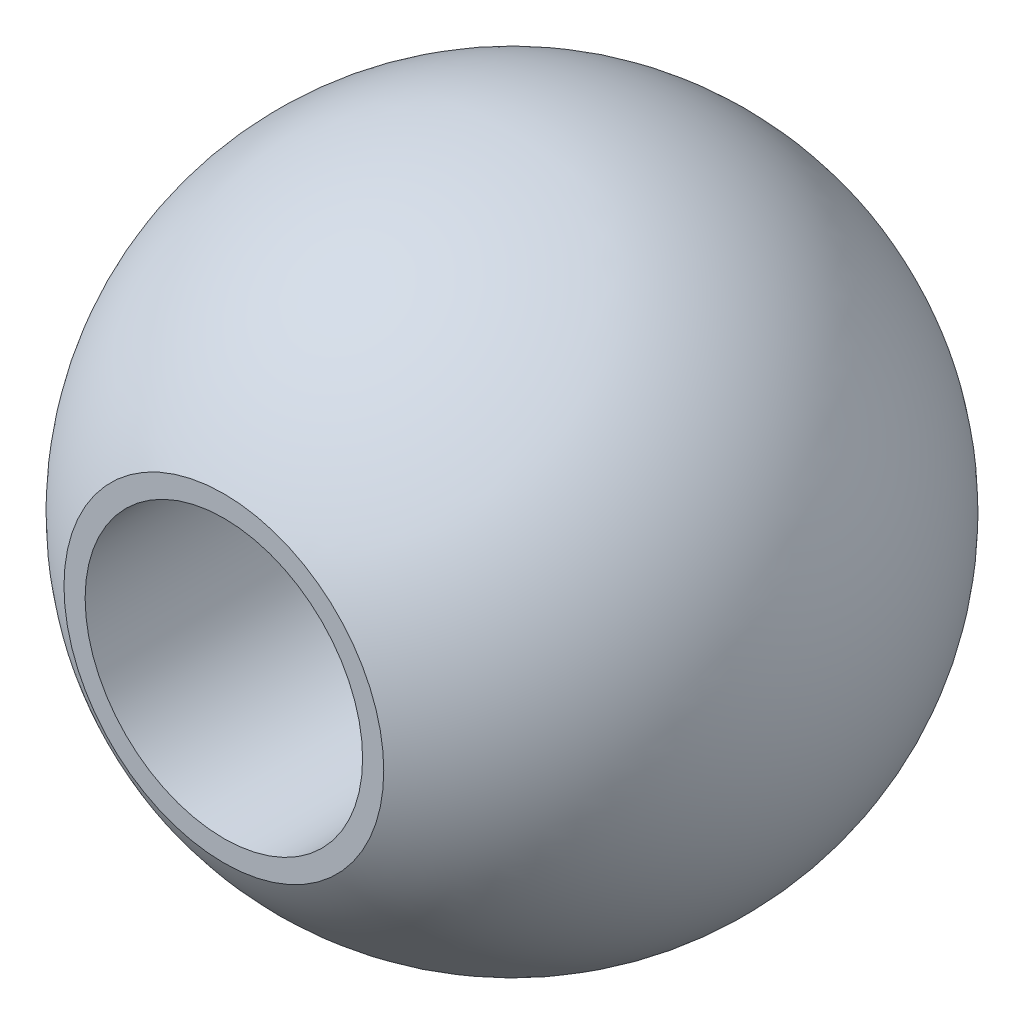
ISO-10303-21;
HEADER;
FILE_DESCRIPTION(('STEP AP214'),'2;1');
FILE_NAME('part.step','',(''),(''),'','','');
FILE_SCHEMA(('AUTOMOTIVE_DESIGN { 1 0 10303 214 1 1 1 1 }'));
ENDSEC;
DATA;
#1=APPLICATION_CONTEXT('core data for automotive mechanical design processes');
#2=APPLICATION_PROTOCOL_DEFINITION('international standard','automotive_design',2000,#1);
#3=PRODUCT_CONTEXT('',#1,'mechanical');
#4=PRODUCT('Part','Part','',(#3));
#5=PRODUCT_RELATED_PRODUCT_CATEGORY('part','',(#4));
#6=PRODUCT_DEFINITION_FORMATION('','',#4);
#7=PRODUCT_DEFINITION_CONTEXT('part definition',#1,'design');
#8=PRODUCT_DEFINITION('design','',#6,#7);
#9=PRODUCT_DEFINITION_SHAPE('','',#8);
#10=(LENGTH_UNIT() NAMED_UNIT(*) SI_UNIT(.MILLI.,.METRE.));
#11=(NAMED_UNIT(*) PLANE_ANGLE_UNIT() SI_UNIT($,.RADIAN.));
#12=(NAMED_UNIT(*) SI_UNIT($,.STERADIAN.) SOLID_ANGLE_UNIT());
#13=UNCERTAINTY_MEASURE_WITH_UNIT(LENGTH_MEASURE(1.E-05),#10,'distance_accuracy_value','');
#14=(GEOMETRIC_REPRESENTATION_CONTEXT(3) GLOBAL_UNCERTAINTY_ASSIGNED_CONTEXT((#13)) GLOBAL_UNIT_ASSIGNED_CONTEXT((#10,
#11,#12)) REPRESENTATION_CONTEXT('',''));
#15=CARTESIAN_POINT('',(0.,0.,0.));
#16=DIRECTION('',(0.,0.,1.));
#17=DIRECTION('',(1.,0.,0.));
#18=AXIS2_PLACEMENT_3D('',#15,#16,#17);
#19=CARTESIAN_POINT('',(0.,0.,-9.5));
#20=DIRECTION('',(0.,0.,1.));
#21=DIRECTION('',(1.,0.,0.));
#22=AXIS2_PLACEMENT_3D('',#19,#20,#21);
#23=CYLINDRICAL_SURFACE('',#22,4.);
#24=CARTESIAN_POINT('',(0.,0.,8.30654470613669));
#25=DIRECTION('',(0.,0.,-1.));
#26=DIRECTION('',(-1.,0.,0.));
#27=AXIS2_PLACEMENT_3D('',#24,#25,#26);
#28=CIRCLE('',#27,4.);
#29=CARTESIAN_POINT('',(-4.,0.,8.30654470613669));
#30=VERTEX_POINT('',#29);
#31=EDGE_CURVE('E44',#30,#30,#28,.F.);
#32=ORIENTED_EDGE('',*,*,#31,.T.);
#33=EDGE_LOOP('',(#32));
#34=FACE_BOUND('',#33,.T.);
#35=CARTESIAN_POINT('',(0.,0.,-8.30654470613669));
#36=DIRECTION('',(0.,0.,1.));
#37=DIRECTION('',(1.,0.,0.));
#38=AXIS2_PLACEMENT_3D('',#35,#36,#37);
#39=CIRCLE('',#38,4.);
#40=CARTESIAN_POINT('',(4.,0.,-8.30654470613669));
#41=VERTEX_POINT('',#40);
#42=EDGE_CURVE('E56',#41,#41,#39,.F.);
#43=ORIENTED_EDGE('',*,*,#42,.T.);
#44=EDGE_LOOP('',(#43));
#45=FACE_BOUND('',#44,.T.);
#46=ADVANCED_FACE('F40',(#34,#45),#23,.F.);
#47=CARTESIAN_POINT('',(-9.5,4.60991486309157,-8.30654470613669));
#48=DIRECTION('',(0.,0.,1.));
#49=DIRECTION('',(1.,0.,0.));
#50=AXIS2_PLACEMENT_3D('',#47,#48,#49);
#51=PLANE('',#50);
#52=ORIENTED_EDGE('',*,*,#42,.F.);
#53=EDGE_LOOP('',(#52));
#54=FACE_BOUND('',#53,.T.);
#55=CARTESIAN_POINT('',(0.,0.,-8.30654470613669));
#56=DIRECTION('',(0.,0.,1.));
#57=DIRECTION('',(1.,0.,0.));
#58=AXIS2_PLACEMENT_3D('',#55,#56,#57);
#59=CIRCLE('',#58,4.60991486309157);
#60=CARTESIAN_POINT('',(4.60991486309157,0.,-8.30654470613669));
#61=VERTEX_POINT('',#60);
#62=EDGE_CURVE('E54',#61,#61,#59,.T.);
#63=ORIENTED_EDGE('',*,*,#62,.F.);
#64=EDGE_LOOP('',(#63));
#65=FACE_BOUND('',#64,.T.);
#66=ADVANCED_FACE('F66',(#54,#65),#51,.F.);
#67=CARTESIAN_POINT('',(-9.5,4.60991486309157,8.30654470613669));
#68=DIRECTION('',(0.,0.,-1.));
#69=DIRECTION('',(-1.,0.,0.));
#70=AXIS2_PLACEMENT_3D('',#67,#68,#69);
#71=PLANE('',#70);
#72=ORIENTED_EDGE('',*,*,#31,.F.);
#73=EDGE_LOOP('',(#72));
#74=FACE_BOUND('',#73,.T.);
#75=CARTESIAN_POINT('',(0.,0.,8.30654470613669));
#76=DIRECTION('',(0.,0.,-1.));
#77=DIRECTION('',(-1.,0.,0.));
#78=AXIS2_PLACEMENT_3D('',#75,#76,#77);
#79=CIRCLE('',#78,4.60991486309157);
#80=CARTESIAN_POINT('',(-4.60991486309157,0.,8.30654470613669));
#81=VERTEX_POINT('',#80);
#82=EDGE_CURVE('E10',#81,#81,#79,.T.);
#83=ORIENTED_EDGE('',*,*,#82,.F.);
#84=EDGE_LOOP('',(#83));
#85=FACE_BOUND('',#84,.T.);
#86=ADVANCED_FACE('F68',(#74,#85),#71,.F.);
#87=CARTESIAN_POINT('',(0.,0.,0.));
#88=DIRECTION('',(0.,-1.,0.));
#89=DIRECTION('',(-1.,0.,0.));
#90=AXIS2_PLACEMENT_3D('',#87,#88,#89);
#91=SPHERICAL_SURFACE('',#90,9.5);
#92=CARTESIAN_POINT('',(0.,0.,0.));
#93=DIRECTION('',(0.,0.,-1.));
#94=DIRECTION('',(-1.,0.,0.));
#95=AXIS2_PLACEMENT_3D('',#92,#93,#94);
#96=SPHERICAL_SURFACE('',#95,9.5);
#97=ORIENTED_EDGE('',*,*,#82,.T.);
#98=EDGE_LOOP('',(#97));
#99=FACE_BOUND('',#98,.T.);
#100=ORIENTED_EDGE('',*,*,#62,.T.);
#101=EDGE_LOOP('',(#100));
#102=FACE_BOUND('',#101,.T.);
#103=ADVANCED_FACE('F42',(#99,#102),#96,.T.);
#104=CLOSED_SHELL('',(#46,#66,#86,#103));
#105=MANIFOLD_SOLID_BREP('B2',#104);
#106=ADVANCED_BREP_SHAPE_REPRESENTATION('',(#18,#105),#14);
#107=SHAPE_DEFINITION_REPRESENTATION(#9,#106);
ENDSEC;
END-ISO-10303-21;
